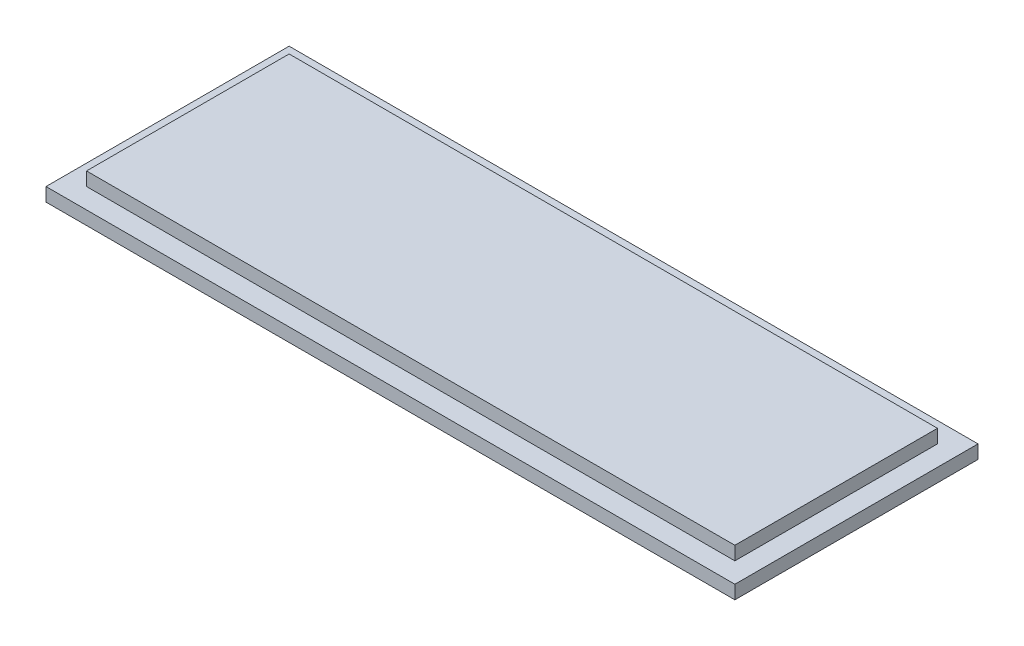
ISO-10303-21;
HEADER;
FILE_DESCRIPTION(('STEP AP214'),'2;1');
FILE_NAME('part.step','',(''),(''),'','','');
FILE_SCHEMA(('AUTOMOTIVE_DESIGN { 1 0 10303 214 1 1 1 1 }'));
ENDSEC;
DATA;
#1=APPLICATION_CONTEXT('core data for automotive mechanical design processes');
#2=APPLICATION_PROTOCOL_DEFINITION('international standard','automotive_design',2000,#1);
#3=PRODUCT_CONTEXT('',#1,'mechanical');
#4=PRODUCT('Part','Part','',(#3));
#5=PRODUCT_RELATED_PRODUCT_CATEGORY('part','',(#4));
#6=PRODUCT_DEFINITION_FORMATION('','',#4);
#7=PRODUCT_DEFINITION_CONTEXT('part definition',#1,'design');
#8=PRODUCT_DEFINITION('design','',#6,#7);
#9=PRODUCT_DEFINITION_SHAPE('','',#8);
#10=(LENGTH_UNIT() NAMED_UNIT(*) SI_UNIT(.MILLI.,.METRE.));
#11=(NAMED_UNIT(*) PLANE_ANGLE_UNIT() SI_UNIT($,.RADIAN.));
#12=(NAMED_UNIT(*) SI_UNIT($,.STERADIAN.) SOLID_ANGLE_UNIT());
#13=UNCERTAINTY_MEASURE_WITH_UNIT(LENGTH_MEASURE(1.E-05),#10,'distance_accuracy_value','');
#14=(GEOMETRIC_REPRESENTATION_CONTEXT(3) GLOBAL_UNCERTAINTY_ASSIGNED_CONTEXT((#13)) GLOBAL_UNIT_ASSIGNED_CONTEXT((#10,
#11,#12)) REPRESENTATION_CONTEXT('',''));
#15=CARTESIAN_POINT('',(0.,0.,0.));
#16=DIRECTION('',(0.,0.,1.));
#17=DIRECTION('',(1.,0.,0.));
#18=AXIS2_PLACEMENT_3D('',#15,#16,#17);
#19=CARTESIAN_POINT('',(0.,1.,0.));
#20=DIRECTION('',(0.,-1.,0.));
#21=DIRECTION('',(0.,0.,-1.));
#22=AXIS2_PLACEMENT_3D('',#19,#20,#21);
#23=PLANE('',#22);
#24=DIRECTION('',(0.,0.,-1.));
#25=VECTOR('',#24,1.);
#26=CARTESIAN_POINT('',(25.5,1.,9.));
#27=LINE('',#26,#25);
#28=CARTESIAN_POINT('',(25.5,1.,9.));
#29=VERTEX_POINT('',#28);
#30=CARTESIAN_POINT('',(25.5,1.,-9.));
#31=VERTEX_POINT('',#30);
#32=EDGE_CURVE('E133',#29,#31,#27,.T.);
#33=ORIENTED_EDGE('',*,*,#32,.T.);
#34=DIRECTION('',(-1.,0.,0.));
#35=VECTOR('',#34,1.);
#36=CARTESIAN_POINT('',(-25.5,1.,-9.));
#37=LINE('',#36,#35);
#38=CARTESIAN_POINT('',(-25.5,1.,-9.));
#39=VERTEX_POINT('',#38);
#40=EDGE_CURVE('E136',#31,#39,#37,.T.);
#41=ORIENTED_EDGE('',*,*,#40,.T.);
#42=DIRECTION('',(0.,0.,1.));
#43=VECTOR('',#42,1.);
#44=CARTESIAN_POINT('',(-25.5,1.,9.));
#45=LINE('',#44,#43);
#46=CARTESIAN_POINT('',(-25.5,1.,9.));
#47=VERTEX_POINT('',#46);
#48=EDGE_CURVE('E139',#39,#47,#45,.T.);
#49=ORIENTED_EDGE('',*,*,#48,.T.);
#50=DIRECTION('',(1.,0.,0.));
#51=VECTOR('',#50,1.);
#52=CARTESIAN_POINT('',(-25.5,1.,9.));
#53=LINE('',#52,#51);
#54=EDGE_CURVE('E141',#47,#29,#53,.T.);
#55=ORIENTED_EDGE('',*,*,#54,.T.);
#56=EDGE_LOOP('',(#33,#41,#49,#55));
#57=FACE_BOUND('',#56,.T.);
#58=DIRECTION('',(0.,0.,-1.));
#59=VECTOR('',#58,1.);
#60=CARTESIAN_POINT('',(24.,1.,-7.5));
#61=LINE('',#60,#59);
#62=CARTESIAN_POINT('',(24.,1.,7.5));
#63=VERTEX_POINT('',#62);
#64=CARTESIAN_POINT('',(24.,1.,-7.5));
#65=VERTEX_POINT('',#64);
#66=EDGE_CURVE('E54',#63,#65,#61,.T.);
#67=ORIENTED_EDGE('',*,*,#66,.F.);
#68=DIRECTION('',(1.,0.,0.));
#69=VECTOR('',#68,1.);
#70=CARTESIAN_POINT('',(-24.,1.,7.5));
#71=LINE('',#70,#69);
#72=CARTESIAN_POINT('',(-24.,1.,7.5));
#73=VERTEX_POINT('',#72);
#74=EDGE_CURVE('E58',#73,#63,#71,.T.);
#75=ORIENTED_EDGE('',*,*,#74,.F.);
#76=DIRECTION('',(0.,0.,1.));
#77=VECTOR('',#76,1.);
#78=CARTESIAN_POINT('',(-24.,1.,-7.5));
#79=LINE('',#78,#77);
#80=CARTESIAN_POINT('',(-24.,1.,-7.5));
#81=VERTEX_POINT('',#80);
#82=EDGE_CURVE('E288',#81,#73,#79,.T.);
#83=ORIENTED_EDGE('',*,*,#82,.F.);
#84=DIRECTION('',(-1.,0.,0.));
#85=VECTOR('',#84,1.);
#86=CARTESIAN_POINT('',(-24.,1.,-7.5));
#87=LINE('',#86,#85);
#88=EDGE_CURVE('E294',#65,#81,#87,.T.);
#89=ORIENTED_EDGE('',*,*,#88,.F.);
#90=EDGE_LOOP('',(#67,#75,#83,#89));
#91=FACE_BOUND('',#90,.T.);
#92=ADVANCED_FACE('F39',(#57,#91),#23,.F.);
#93=CARTESIAN_POINT('',(25.5,1.,9.));
#94=DIRECTION('',(-1.,0.,0.));
#95=DIRECTION('',(0.,0.,1.));
#96=AXIS2_PLACEMENT_3D('',#93,#94,#95);
#97=PLANE('',#96);
#98=DIRECTION('',(0.,0.,-1.));
#99=VECTOR('',#98,1.);
#100=CARTESIAN_POINT('',(25.5,0.,9.));
#101=LINE('',#100,#99);
#102=CARTESIAN_POINT('',(25.5,0.,9.));
#103=VERTEX_POINT('',#102);
#104=CARTESIAN_POINT('',(25.5,0.,-9.));
#105=VERTEX_POINT('',#104);
#106=EDGE_CURVE('E124',#103,#105,#101,.T.);
#107=ORIENTED_EDGE('',*,*,#106,.T.);
#108=DIRECTION('',(0.,-1.,0.));
#109=VECTOR('',#108,1.);
#110=CARTESIAN_POINT('',(25.5,1.,-9.));
#111=LINE('',#110,#109);
#112=EDGE_CURVE('E11',#31,#105,#111,.T.);
#113=ORIENTED_EDGE('',*,*,#112,.F.);
#114=ORIENTED_EDGE('',*,*,#32,.F.);
#115=DIRECTION('',(0.,-1.,0.));
#116=VECTOR('',#115,1.);
#117=CARTESIAN_POINT('',(25.5,1.,9.));
#118=LINE('',#117,#116);
#119=EDGE_CURVE('E142',#29,#103,#118,.T.);
#120=ORIENTED_EDGE('',*,*,#119,.T.);
#121=EDGE_LOOP('',(#107,#113,#114,#120));
#122=FACE_BOUND('',#121,.T.);
#123=ADVANCED_FACE('F41',(#122),#97,.F.);
#124=CARTESIAN_POINT('',(-25.5,1.,-9.));
#125=DIRECTION('',(0.,0.,1.));
#126=DIRECTION('',(1.,0.,0.));
#127=AXIS2_PLACEMENT_3D('',#124,#125,#126);
#128=PLANE('',#127);
#129=DIRECTION('',(-1.,0.,0.));
#130=VECTOR('',#129,1.);
#131=CARTESIAN_POINT('',(-25.5,0.,-9.));
#132=LINE('',#131,#130);
#133=CARTESIAN_POINT('',(-25.5,0.,-9.));
#134=VERTEX_POINT('',#133);
#135=EDGE_CURVE('E127',#105,#134,#132,.T.);
#136=ORIENTED_EDGE('',*,*,#135,.T.);
#137=DIRECTION('',(0.,-1.,0.));
#138=VECTOR('',#137,1.);
#139=CARTESIAN_POINT('',(-25.5,1.,-9.));
#140=LINE('',#139,#138);
#141=EDGE_CURVE('E47',#39,#134,#140,.T.);
#142=ORIENTED_EDGE('',*,*,#141,.F.);
#143=ORIENTED_EDGE('',*,*,#40,.F.);
#144=ORIENTED_EDGE('',*,*,#112,.T.);
#145=EDGE_LOOP('',(#136,#142,#143,#144));
#146=FACE_BOUND('',#145,.T.);
#147=ADVANCED_FACE('F172',(#146),#128,.F.);
#148=CARTESIAN_POINT('',(-25.5,1.,9.));
#149=DIRECTION('',(1.,0.,0.));
#150=DIRECTION('',(0.,0.,-1.));
#151=AXIS2_PLACEMENT_3D('',#148,#149,#150);
#152=PLANE('',#151);
#153=DIRECTION('',(0.,0.,1.));
#154=VECTOR('',#153,1.);
#155=CARTESIAN_POINT('',(-25.5,0.,9.));
#156=LINE('',#155,#154);
#157=CARTESIAN_POINT('',(-25.5,0.,9.));
#158=VERTEX_POINT('',#157);
#159=EDGE_CURVE('E145',#134,#158,#156,.T.);
#160=ORIENTED_EDGE('',*,*,#159,.T.);
#161=DIRECTION('',(0.,-1.,0.));
#162=VECTOR('',#161,1.);
#163=CARTESIAN_POINT('',(-25.5,1.,9.));
#164=LINE('',#163,#162);
#165=EDGE_CURVE('E150',#47,#158,#164,.T.);
#166=ORIENTED_EDGE('',*,*,#165,.F.);
#167=ORIENTED_EDGE('',*,*,#48,.F.);
#168=ORIENTED_EDGE('',*,*,#141,.T.);
#169=EDGE_LOOP('',(#160,#166,#167,#168));
#170=FACE_BOUND('',#169,.T.);
#171=ADVANCED_FACE('F157',(#170),#152,.F.);
#172=CARTESIAN_POINT('',(-25.5,1.,9.));
#173=DIRECTION('',(0.,0.,-1.));
#174=DIRECTION('',(-1.,0.,0.));
#175=AXIS2_PLACEMENT_3D('',#172,#173,#174);
#176=PLANE('',#175);
#177=DIRECTION('',(1.,0.,0.));
#178=VECTOR('',#177,1.);
#179=CARTESIAN_POINT('',(-25.5,0.,9.));
#180=LINE('',#179,#178);
#181=EDGE_CURVE('E137',#158,#103,#180,.T.);
#182=ORIENTED_EDGE('',*,*,#181,.T.);
#183=ORIENTED_EDGE('',*,*,#119,.F.);
#184=ORIENTED_EDGE('',*,*,#54,.F.);
#185=ORIENTED_EDGE('',*,*,#165,.T.);
#186=EDGE_LOOP('',(#182,#183,#184,#185));
#187=FACE_BOUND('',#186,.T.);
#188=ADVANCED_FACE('F166',(#187),#176,.F.);
#189=CARTESIAN_POINT('',(0.,0.,0.));
#190=DIRECTION('',(0.,-1.,0.));
#191=DIRECTION('',(0.,0.,-1.));
#192=AXIS2_PLACEMENT_3D('',#189,#190,#191);
#193=PLANE('',#192);
#194=ORIENTED_EDGE('',*,*,#106,.F.);
#195=ORIENTED_EDGE('',*,*,#181,.F.);
#196=ORIENTED_EDGE('',*,*,#159,.F.);
#197=ORIENTED_EDGE('',*,*,#135,.F.);
#198=EDGE_LOOP('',(#194,#195,#196,#197));
#199=FACE_BOUND('',#198,.T.);
#200=ADVANCED_FACE('F163',(#199),#193,.T.);
#201=CARTESIAN_POINT('',(24.,2.,-7.5));
#202=DIRECTION('',(-1.,0.,0.));
#203=DIRECTION('',(0.,0.,1.));
#204=AXIS2_PLACEMENT_3D('',#201,#202,#203);
#205=PLANE('',#204);
#206=ORIENTED_EDGE('',*,*,#66,.T.);
#207=DIRECTION('',(0.,-1.,0.));
#208=VECTOR('',#207,1.);
#209=CARTESIAN_POINT('',(24.,2.,-7.5));
#210=LINE('',#209,#208);
#211=CARTESIAN_POINT('',(24.,2.,-7.5));
#212=VERTEX_POINT('',#211);
#213=EDGE_CURVE('E107',#212,#65,#210,.T.);
#214=ORIENTED_EDGE('',*,*,#213,.F.);
#215=DIRECTION('',(0.,0.,-1.));
#216=VECTOR('',#215,1.);
#217=CARTESIAN_POINT('',(24.,2.,-7.5));
#218=LINE('',#217,#216);
#219=CARTESIAN_POINT('',(24.,2.,7.5));
#220=VERTEX_POINT('',#219);
#221=EDGE_CURVE('E113',#220,#212,#218,.T.);
#222=ORIENTED_EDGE('',*,*,#221,.F.);
#223=DIRECTION('',(0.,-1.,0.));
#224=VECTOR('',#223,1.);
#225=CARTESIAN_POINT('',(24.,2.,7.5));
#226=LINE('',#225,#224);
#227=EDGE_CURVE('E286',#220,#63,#226,.T.);
#228=ORIENTED_EDGE('',*,*,#227,.T.);
#229=EDGE_LOOP('',(#206,#214,#222,#228));
#230=FACE_BOUND('',#229,.T.);
#231=ADVANCED_FACE('F123',(#230),#205,.F.);
#232=CARTESIAN_POINT('',(-24.,2.,-7.5));
#233=DIRECTION('',(0.,0.,1.));
#234=DIRECTION('',(1.,0.,0.));
#235=AXIS2_PLACEMENT_3D('',#232,#233,#234);
#236=PLANE('',#235);
#237=ORIENTED_EDGE('',*,*,#88,.T.);
#238=DIRECTION('',(0.,-1.,0.));
#239=VECTOR('',#238,1.);
#240=CARTESIAN_POINT('',(-24.,2.,-7.5));
#241=LINE('',#240,#239);
#242=CARTESIAN_POINT('',(-24.,2.,-7.5));
#243=VERTEX_POINT('',#242);
#244=EDGE_CURVE('E109',#243,#81,#241,.T.);
#245=ORIENTED_EDGE('',*,*,#244,.F.);
#246=DIRECTION('',(-1.,0.,0.));
#247=VECTOR('',#246,1.);
#248=CARTESIAN_POINT('',(-24.,2.,-7.5));
#249=LINE('',#248,#247);
#250=EDGE_CURVE('E102',#212,#243,#249,.T.);
#251=ORIENTED_EDGE('',*,*,#250,.F.);
#252=ORIENTED_EDGE('',*,*,#213,.T.);
#253=EDGE_LOOP('',(#237,#245,#251,#252));
#254=FACE_BOUND('',#253,.T.);
#255=ADVANCED_FACE('F105',(#254),#236,.F.);
#256=CARTESIAN_POINT('',(-24.,2.,-7.5));
#257=DIRECTION('',(1.,0.,0.));
#258=DIRECTION('',(0.,0.,-1.));
#259=AXIS2_PLACEMENT_3D('',#256,#257,#258);
#260=PLANE('',#259);
#261=ORIENTED_EDGE('',*,*,#82,.T.);
#262=DIRECTION('',(0.,-1.,0.));
#263=VECTOR('',#262,1.);
#264=CARTESIAN_POINT('',(-24.,2.,7.5));
#265=LINE('',#264,#263);
#266=CARTESIAN_POINT('',(-24.,2.,7.5));
#267=VERTEX_POINT('',#266);
#268=EDGE_CURVE('E129',#267,#73,#265,.T.);
#269=ORIENTED_EDGE('',*,*,#268,.F.);
#270=DIRECTION('',(0.,0.,1.));
#271=VECTOR('',#270,1.);
#272=CARTESIAN_POINT('',(-24.,2.,-7.5));
#273=LINE('',#272,#271);
#274=EDGE_CURVE('E112',#243,#267,#273,.T.);
#275=ORIENTED_EDGE('',*,*,#274,.F.);
#276=ORIENTED_EDGE('',*,*,#244,.T.);
#277=EDGE_LOOP('',(#261,#269,#275,#276));
#278=FACE_BOUND('',#277,.T.);
#279=ADVANCED_FACE('F208',(#278),#260,.F.);
#280=CARTESIAN_POINT('',(-24.,2.,7.5));
#281=DIRECTION('',(0.,0.,-1.));
#282=DIRECTION('',(-1.,0.,0.));
#283=AXIS2_PLACEMENT_3D('',#280,#281,#282);
#284=PLANE('',#283);
#285=ORIENTED_EDGE('',*,*,#74,.T.);
#286=ORIENTED_EDGE('',*,*,#227,.F.);
#287=DIRECTION('',(1.,0.,0.));
#288=VECTOR('',#287,1.);
#289=CARTESIAN_POINT('',(-24.,2.,7.5));
#290=LINE('',#289,#288);
#291=EDGE_CURVE('E118',#267,#220,#290,.T.);
#292=ORIENTED_EDGE('',*,*,#291,.F.);
#293=ORIENTED_EDGE('',*,*,#268,.T.);
#294=EDGE_LOOP('',(#285,#286,#292,#293));
#295=FACE_BOUND('',#294,.T.);
#296=ADVANCED_FACE('F214',(#295),#284,.F.);
#297=CARTESIAN_POINT('',(0.,2.,0.));
#298=DIRECTION('',(0.,1.,0.));
#299=DIRECTION('',(0.,0.,1.));
#300=AXIS2_PLACEMENT_3D('',#297,#298,#299);
#301=PLANE('',#300);
#302=ORIENTED_EDGE('',*,*,#221,.T.);
#303=ORIENTED_EDGE('',*,*,#250,.T.);
#304=ORIENTED_EDGE('',*,*,#274,.T.);
#305=ORIENTED_EDGE('',*,*,#291,.T.);
#306=EDGE_LOOP('',(#302,#303,#304,#305));
#307=FACE_BOUND('',#306,.T.);
#308=ADVANCED_FACE('F116',(#307),#301,.T.);
#309=CLOSED_SHELL('',(#92,#123,#147,#171,#188,#200,#231,#255,#279,#296,#308));
#310=MANIFOLD_SOLID_BREP('B2',#309);
#311=ADVANCED_BREP_SHAPE_REPRESENTATION('',(#18,#310),#14);
#312=SHAPE_DEFINITION_REPRESENTATION(#9,#311);
ENDSEC;
END-ISO-10303-21;
